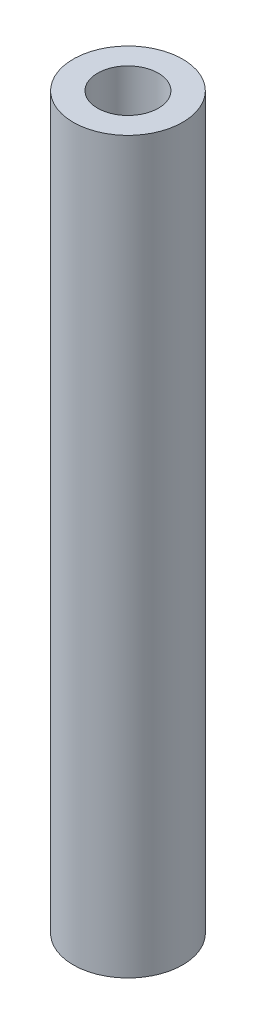
ISO-10303-21;
HEADER;
FILE_DESCRIPTION(('STEP AP214'),'2;1');
FILE_NAME('part.step','',(''),(''),'','','');
FILE_SCHEMA(('AUTOMOTIVE_DESIGN { 1 0 10303 214 1 1 1 1 }'));
ENDSEC;
DATA;
#1=APPLICATION_CONTEXT('core data for automotive mechanical design processes');
#2=APPLICATION_PROTOCOL_DEFINITION('international standard','automotive_design',2000,#1);
#3=PRODUCT_CONTEXT('',#1,'mechanical');
#4=PRODUCT('Part','Part','',(#3));
#5=PRODUCT_RELATED_PRODUCT_CATEGORY('part','',(#4));
#6=PRODUCT_DEFINITION_FORMATION('','',#4);
#7=PRODUCT_DEFINITION_CONTEXT('part definition',#1,'design');
#8=PRODUCT_DEFINITION('design','',#6,#7);
#9=PRODUCT_DEFINITION_SHAPE('','',#8);
#10=(LENGTH_UNIT() NAMED_UNIT(*) SI_UNIT(.MILLI.,.METRE.));
#11=(NAMED_UNIT(*) PLANE_ANGLE_UNIT() SI_UNIT($,.RADIAN.));
#12=(NAMED_UNIT(*) SI_UNIT($,.STERADIAN.) SOLID_ANGLE_UNIT());
#13=UNCERTAINTY_MEASURE_WITH_UNIT(LENGTH_MEASURE(1.E-05),#10,'distance_accuracy_value','');
#14=(GEOMETRIC_REPRESENTATION_CONTEXT(3) GLOBAL_UNCERTAINTY_ASSIGNED_CONTEXT((#13)) GLOBAL_UNIT_ASSIGNED_CONTEXT((#10,
#11,#12)) REPRESENTATION_CONTEXT('',''));
#15=CARTESIAN_POINT('',(0.,0.,0.));
#16=DIRECTION('',(0.,0.,1.));
#17=DIRECTION('',(1.,0.,0.));
#18=AXIS2_PLACEMENT_3D('',#15,#16,#17);
#19=CARTESIAN_POINT('',(1.40789685201526,38.1,0.));
#20=DIRECTION('',(0.,1.,0.));
#21=DIRECTION('',(0.,0.,1.));
#22=AXIS2_PLACEMENT_3D('',#19,#20,#21);
#23=PLANE('',#22);
#24=CARTESIAN_POINT('',(1.40789685201526,38.1,0.));
#25=DIRECTION('',(0.,1.,0.));
#26=DIRECTION('',(0.,0.,1.));
#27=AXIS2_PLACEMENT_3D('',#24,#25,#26);
#28=CIRCLE('',#27,2.8575);
#29=CARTESIAN_POINT('',(1.40789685201526,38.1,2.8575));
#30=VERTEX_POINT('',#29);
#31=EDGE_CURVE('E10',#30,#30,#28,.T.);
#32=ORIENTED_EDGE('',*,*,#31,.T.);
#33=EDGE_LOOP('',(#32));
#34=FACE_BOUND('',#33,.T.);
#35=CARTESIAN_POINT('',(1.40789685201526,38.1,0.));
#36=DIRECTION('',(0.,1.,0.));
#37=DIRECTION('',(0.,0.,1.));
#38=AXIS2_PLACEMENT_3D('',#35,#36,#37);
#39=CIRCLE('',#38,1.5875);
#40=CARTESIAN_POINT('',(1.40789685201526,38.1,1.5875));
#41=VERTEX_POINT('',#40);
#42=EDGE_CURVE('E42',#41,#41,#39,.T.);
#43=ORIENTED_EDGE('',*,*,#42,.F.);
#44=EDGE_LOOP('',(#43));
#45=FACE_BOUND('',#44,.T.);
#46=ADVANCED_FACE('F31',(#34,#45),#23,.T.);
#47=CARTESIAN_POINT('',(1.40789685201526,0.,0.));
#48=DIRECTION('',(0.,1.,0.));
#49=DIRECTION('',(0.,0.,1.));
#50=AXIS2_PLACEMENT_3D('',#47,#48,#49);
#51=PLANE('',#50);
#52=CARTESIAN_POINT('',(1.40789685201526,0.,0.));
#53=DIRECTION('',(0.,1.,0.));
#54=DIRECTION('',(0.,0.,1.));
#55=AXIS2_PLACEMENT_3D('',#52,#53,#54);
#56=CIRCLE('',#55,2.8575);
#57=CARTESIAN_POINT('',(1.40789685201526,0.,2.8575));
#58=VERTEX_POINT('',#57);
#59=EDGE_CURVE('E35',#58,#58,#56,.T.);
#60=ORIENTED_EDGE('',*,*,#59,.F.);
#61=EDGE_LOOP('',(#60));
#62=FACE_BOUND('',#61,.T.);
#63=CARTESIAN_POINT('',(1.40789685201526,0.,0.));
#64=DIRECTION('',(0.,1.,0.));
#65=DIRECTION('',(0.,0.,1.));
#66=AXIS2_PLACEMENT_3D('',#63,#64,#65);
#67=CIRCLE('',#66,1.5875);
#68=CARTESIAN_POINT('',(1.40789685201526,0.,1.5875));
#69=VERTEX_POINT('',#68);
#70=EDGE_CURVE('E44',#69,#69,#67,.T.);
#71=ORIENTED_EDGE('',*,*,#70,.T.);
#72=EDGE_LOOP('',(#71));
#73=FACE_BOUND('',#72,.T.);
#74=ADVANCED_FACE('F54',(#62,#73),#51,.F.);
#75=CARTESIAN_POINT('',(1.40789685201526,38.1,0.));
#76=DIRECTION('',(0.,-1.,0.));
#77=DIRECTION('',(0.,0.,-1.));
#78=AXIS2_PLACEMENT_3D('',#75,#76,#77);
#79=CYLINDRICAL_SURFACE('',#78,2.8575);
#80=ORIENTED_EDGE('',*,*,#31,.F.);
#81=EDGE_LOOP('',(#80));
#82=FACE_BOUND('',#81,.T.);
#83=ORIENTED_EDGE('',*,*,#59,.T.);
#84=EDGE_LOOP('',(#83));
#85=FACE_BOUND('',#84,.T.);
#86=ADVANCED_FACE('F33',(#82,#85),#79,.T.);
#87=CARTESIAN_POINT('',(1.40789685201526,38.1,0.));
#88=DIRECTION('',(0.,-1.,0.));
#89=DIRECTION('',(0.,0.,-1.));
#90=AXIS2_PLACEMENT_3D('',#87,#88,#89);
#91=CYLINDRICAL_SURFACE('',#90,1.5875);
#92=ORIENTED_EDGE('',*,*,#42,.T.);
#93=EDGE_LOOP('',(#92));
#94=FACE_BOUND('',#93,.T.);
#95=ORIENTED_EDGE('',*,*,#70,.F.);
#96=EDGE_LOOP('',(#95));
#97=FACE_BOUND('',#96,.T.);
#98=ADVANCED_FACE('F50',(#94,#97),#91,.F.);
#99=CLOSED_SHELL('',(#46,#74,#86,#98));
#100=MANIFOLD_SOLID_BREP('B2',#99);
#101=ADVANCED_BREP_SHAPE_REPRESENTATION('',(#18,#100),#14);
#102=SHAPE_DEFINITION_REPRESENTATION(#9,#101);
ENDSEC;
END-ISO-10303-21;
